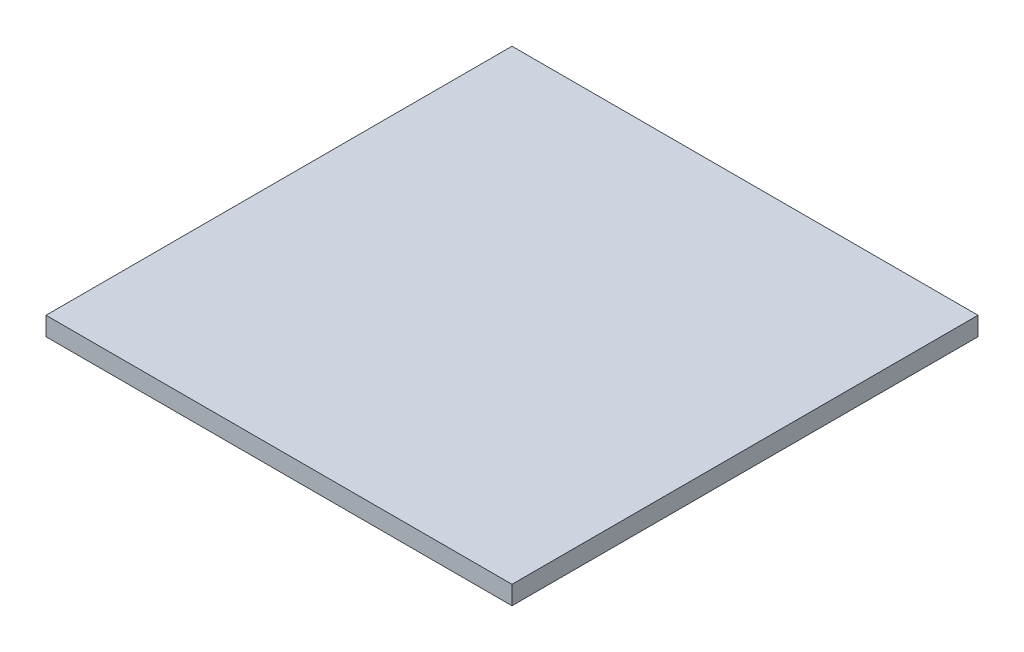
ISO-10303-21;
HEADER;
FILE_DESCRIPTION(('STEP AP214'),'2;1');
FILE_NAME('part.step','',(''),(''),'','','');
FILE_SCHEMA(('AUTOMOTIVE_DESIGN { 1 0 10303 214 1 1 1 1 }'));
ENDSEC;
DATA;
#1=APPLICATION_CONTEXT('core data for automotive mechanical design processes');
#2=APPLICATION_PROTOCOL_DEFINITION('international standard','automotive_design',2000,#1);
#3=PRODUCT_CONTEXT('',#1,'mechanical');
#4=PRODUCT('Part','Part','',(#3));
#5=PRODUCT_RELATED_PRODUCT_CATEGORY('part','',(#4));
#6=PRODUCT_DEFINITION_FORMATION('','',#4);
#7=PRODUCT_DEFINITION_CONTEXT('part definition',#1,'design');
#8=PRODUCT_DEFINITION('design','',#6,#7);
#9=PRODUCT_DEFINITION_SHAPE('','',#8);
#10=(LENGTH_UNIT() NAMED_UNIT(*) SI_UNIT(.MILLI.,.METRE.));
#11=(NAMED_UNIT(*) PLANE_ANGLE_UNIT() SI_UNIT($,.RADIAN.));
#12=(NAMED_UNIT(*) SI_UNIT($,.STERADIAN.) SOLID_ANGLE_UNIT());
#13=UNCERTAINTY_MEASURE_WITH_UNIT(LENGTH_MEASURE(1.E-05),#10,'distance_accuracy_value','');
#14=(GEOMETRIC_REPRESENTATION_CONTEXT(3) GLOBAL_UNCERTAINTY_ASSIGNED_CONTEXT((#13)) GLOBAL_UNIT_ASSIGNED_CONTEXT((#10,
#11,#12)) REPRESENTATION_CONTEXT('',''));
#15=CARTESIAN_POINT('',(0.,0.,0.));
#16=DIRECTION('',(0.,0.,1.));
#17=DIRECTION('',(1.,0.,0.));
#18=AXIS2_PLACEMENT_3D('',#15,#16,#17);
#19=CARTESIAN_POINT('',(-20.9100374543613,1.,-16.2318818617253));
#20=DIRECTION('',(1.,0.,0.));
#21=DIRECTION('',(0.,0.,-1.));
#22=AXIS2_PLACEMENT_3D('',#19,#20,#21);
#23=PLANE('',#22);
#24=DIRECTION('',(0.,0.,1.));
#25=VECTOR('',#24,1.);
#26=CARTESIAN_POINT('',(-20.9100374543613,0.,-16.2318818617253));
#27=LINE('',#26,#25);
#28=CARTESIAN_POINT('',(-20.9100374543613,0.,-16.2318818617253));
#29=VERTEX_POINT('',#28);
#30=CARTESIAN_POINT('',(-20.9100374543613,0.,8.76811813827472));
#31=VERTEX_POINT('',#30);
#32=EDGE_CURVE('E96',#29,#31,#27,.T.);
#33=ORIENTED_EDGE('',*,*,#32,.T.);
#34=DIRECTION('',(0.,-1.,0.));
#35=VECTOR('',#34,1.);
#36=CARTESIAN_POINT('',(-20.9100374543613,1.,8.76811813827472));
#37=LINE('',#36,#35);
#38=CARTESIAN_POINT('',(-20.9100374543613,1.,8.76811813827472));
#39=VERTEX_POINT('',#38);
#40=EDGE_CURVE('E11',#39,#31,#37,.T.);
#41=ORIENTED_EDGE('',*,*,#40,.F.);
#42=DIRECTION('',(0.,0.,1.));
#43=VECTOR('',#42,1.);
#44=CARTESIAN_POINT('',(-20.9100374543613,1.,-16.2318818617253));
#45=LINE('',#44,#43);
#46=CARTESIAN_POINT('',(-20.9100374543613,1.,-16.2318818617253));
#47=VERTEX_POINT('',#46);
#48=EDGE_CURVE('E84',#47,#39,#45,.T.);
#49=ORIENTED_EDGE('',*,*,#48,.F.);
#50=DIRECTION('',(0.,-1.,0.));
#51=VECTOR('',#50,1.);
#52=CARTESIAN_POINT('',(-20.9100374543613,1.,-16.2318818617253));
#53=LINE('',#52,#51);
#54=EDGE_CURVE('E92',#47,#29,#53,.T.);
#55=ORIENTED_EDGE('',*,*,#54,.T.);
#56=EDGE_LOOP('',(#33,#41,#49,#55));
#57=FACE_BOUND('',#56,.T.);
#58=ADVANCED_FACE('F33',(#57),#23,.F.);
#59=CARTESIAN_POINT('',(-20.9100374543613,1.,8.76811813827472));
#60=DIRECTION('',(0.,0.,-1.));
#61=DIRECTION('',(-1.,0.,0.));
#62=AXIS2_PLACEMENT_3D('',#59,#60,#61);
#63=PLANE('',#62);
#64=DIRECTION('',(1.,0.,0.));
#65=VECTOR('',#64,1.);
#66=CARTESIAN_POINT('',(-20.9100374543613,0.,8.76811813827472));
#67=LINE('',#66,#65);
#68=CARTESIAN_POINT('',(4.08996254563867,0.,8.76811813827472));
#69=VERTEX_POINT('',#68);
#70=EDGE_CURVE('E88',#31,#69,#67,.T.);
#71=ORIENTED_EDGE('',*,*,#70,.T.);
#72=DIRECTION('',(0.,-1.,0.));
#73=VECTOR('',#72,1.);
#74=CARTESIAN_POINT('',(4.08996254563867,1.,8.76811813827472));
#75=LINE('',#74,#73);
#76=CARTESIAN_POINT('',(4.08996254563867,1.,8.76811813827472));
#77=VERTEX_POINT('',#76);
#78=EDGE_CURVE('E41',#77,#69,#75,.T.);
#79=ORIENTED_EDGE('',*,*,#78,.F.);
#80=DIRECTION('',(1.,0.,0.));
#81=VECTOR('',#80,1.);
#82=CARTESIAN_POINT('',(-20.9100374543613,1.,8.76811813827472));
#83=LINE('',#82,#81);
#84=EDGE_CURVE('E79',#39,#77,#83,.T.);
#85=ORIENTED_EDGE('',*,*,#84,.F.);
#86=ORIENTED_EDGE('',*,*,#40,.T.);
#87=EDGE_LOOP('',(#71,#79,#85,#86));
#88=FACE_BOUND('',#87,.T.);
#89=ADVANCED_FACE('F87',(#88),#63,.F.);
#90=CARTESIAN_POINT('',(4.08996254563867,1.,-16.2318818617253));
#91=DIRECTION('',(-1.,0.,0.));
#92=DIRECTION('',(0.,0.,1.));
#93=AXIS2_PLACEMENT_3D('',#90,#91,#92);
#94=PLANE('',#93);
#95=DIRECTION('',(0.,0.,-1.));
#96=VECTOR('',#95,1.);
#97=CARTESIAN_POINT('',(4.08996254563867,0.,-16.2318818617253));
#98=LINE('',#97,#96);
#99=CARTESIAN_POINT('',(4.08996254563867,0.,-16.2318818617253));
#100=VERTEX_POINT('',#99);
#101=EDGE_CURVE('E66',#69,#100,#98,.T.);
#102=ORIENTED_EDGE('',*,*,#101,.T.);
#103=DIRECTION('',(0.,-1.,0.));
#104=VECTOR('',#103,1.);
#105=CARTESIAN_POINT('',(4.08996254563867,1.,-16.2318818617253));
#106=LINE('',#105,#104);
#107=CARTESIAN_POINT('',(4.08996254563867,1.,-16.2318818617253));
#108=VERTEX_POINT('',#107);
#109=EDGE_CURVE('E89',#108,#100,#106,.T.);
#110=ORIENTED_EDGE('',*,*,#109,.F.);
#111=DIRECTION('',(0.,0.,-1.));
#112=VECTOR('',#111,1.);
#113=CARTESIAN_POINT('',(4.08996254563867,1.,-16.2318818617253));
#114=LINE('',#113,#112);
#115=EDGE_CURVE('E82',#77,#108,#114,.T.);
#116=ORIENTED_EDGE('',*,*,#115,.F.);
#117=ORIENTED_EDGE('',*,*,#78,.T.);
#118=EDGE_LOOP('',(#102,#110,#116,#117));
#119=FACE_BOUND('',#118,.T.);
#120=ADVANCED_FACE('F90',(#119),#94,.F.);
#121=CARTESIAN_POINT('',(-20.9100374543613,1.,-16.2318818617253));
#122=DIRECTION('',(0.,0.,1.));
#123=DIRECTION('',(1.,0.,0.));
#124=AXIS2_PLACEMENT_3D('',#121,#122,#123);
#125=PLANE('',#124);
#126=DIRECTION('',(-1.,0.,0.));
#127=VECTOR('',#126,1.);
#128=CARTESIAN_POINT('',(-20.9100374543613,0.,-16.2318818617253));
#129=LINE('',#128,#127);
#130=EDGE_CURVE('E72',#100,#29,#129,.T.);
#131=ORIENTED_EDGE('',*,*,#130,.T.);
#132=ORIENTED_EDGE('',*,*,#54,.F.);
#133=DIRECTION('',(-1.,0.,0.));
#134=VECTOR('',#133,1.);
#135=CARTESIAN_POINT('',(-20.9100374543613,1.,-16.2318818617253));
#136=LINE('',#135,#134);
#137=EDGE_CURVE('E49',#108,#47,#136,.T.);
#138=ORIENTED_EDGE('',*,*,#137,.F.);
#139=ORIENTED_EDGE('',*,*,#109,.T.);
#140=EDGE_LOOP('',(#131,#132,#138,#139));
#141=FACE_BOUND('',#140,.T.);
#142=ADVANCED_FACE('F103',(#141),#125,.F.);
#143=CARTESIAN_POINT('',(0.,1.,0.));
#144=DIRECTION('',(0.,1.,0.));
#145=DIRECTION('',(0.,0.,1.));
#146=AXIS2_PLACEMENT_3D('',#143,#144,#145);
#147=PLANE('',#146);
#148=ORIENTED_EDGE('',*,*,#48,.T.);
#149=ORIENTED_EDGE('',*,*,#84,.T.);
#150=ORIENTED_EDGE('',*,*,#115,.T.);
#151=ORIENTED_EDGE('',*,*,#137,.T.);
#152=EDGE_LOOP('',(#148,#149,#150,#151));
#153=FACE_BOUND('',#152,.T.);
#154=ADVANCED_FACE('F80',(#153),#147,.T.);
#155=CARTESIAN_POINT('',(0.,0.,0.));
#156=DIRECTION('',(0.,1.,0.));
#157=DIRECTION('',(0.,0.,1.));
#158=AXIS2_PLACEMENT_3D('',#155,#156,#157);
#159=PLANE('',#158);
#160=ORIENTED_EDGE('',*,*,#32,.F.);
#161=ORIENTED_EDGE('',*,*,#130,.F.);
#162=ORIENTED_EDGE('',*,*,#101,.F.);
#163=ORIENTED_EDGE('',*,*,#70,.F.);
#164=EDGE_LOOP('',(#160,#161,#162,#163));
#165=FACE_BOUND('',#164,.T.);
#166=ADVANCED_FACE('F106',(#165),#159,.F.);
#167=CLOSED_SHELL('',(#58,#89,#120,#142,#154,#166));
#168=MANIFOLD_SOLID_BREP('B2',#167);
#169=ADVANCED_BREP_SHAPE_REPRESENTATION('',(#18,#168),#14);
#170=SHAPE_DEFINITION_REPRESENTATION(#9,#169);
ENDSEC;
END-ISO-10303-21;
